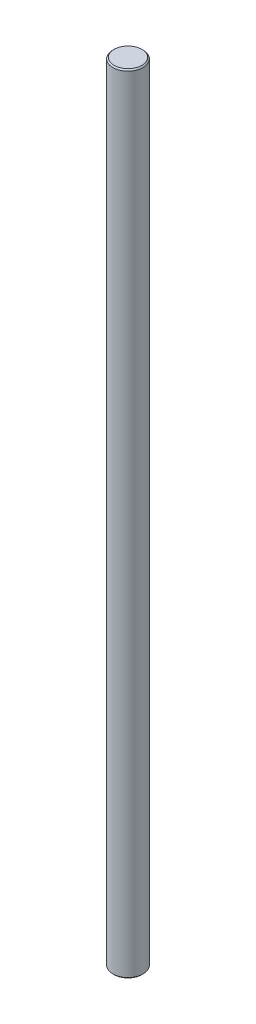
ISO-10303-21;
HEADER;
FILE_DESCRIPTION(('STEP AP214'),'2;1');
FILE_NAME('part.step','',(''),(''),'','','');
FILE_SCHEMA(('AUTOMOTIVE_DESIGN { 1 0 10303 214 1 1 1 1 }'));
ENDSEC;
DATA;
#1=APPLICATION_CONTEXT('core data for automotive mechanical design processes');
#2=APPLICATION_PROTOCOL_DEFINITION('international standard','automotive_design',2000,#1);
#3=PRODUCT_CONTEXT('',#1,'mechanical');
#4=PRODUCT('Part','Part','',(#3));
#5=PRODUCT_RELATED_PRODUCT_CATEGORY('part','',(#4));
#6=PRODUCT_DEFINITION_FORMATION('','',#4);
#7=PRODUCT_DEFINITION_CONTEXT('part definition',#1,'design');
#8=PRODUCT_DEFINITION('design','',#6,#7);
#9=PRODUCT_DEFINITION_SHAPE('','',#8);
#10=(LENGTH_UNIT() NAMED_UNIT(*) SI_UNIT(.MILLI.,.METRE.));
#11=(NAMED_UNIT(*) PLANE_ANGLE_UNIT() SI_UNIT($,.RADIAN.));
#12=(NAMED_UNIT(*) SI_UNIT($,.STERADIAN.) SOLID_ANGLE_UNIT());
#13=UNCERTAINTY_MEASURE_WITH_UNIT(LENGTH_MEASURE(1.E-05),#10,'distance_accuracy_value','');
#14=(GEOMETRIC_REPRESENTATION_CONTEXT(3) GLOBAL_UNCERTAINTY_ASSIGNED_CONTEXT((#13)) GLOBAL_UNIT_ASSIGNED_CONTEXT((#10,
#11,#12)) REPRESENTATION_CONTEXT('',''));
#15=CARTESIAN_POINT('',(0.,0.,0.));
#16=DIRECTION('',(0.,0.,1.));
#17=DIRECTION('',(1.,0.,0.));
#18=AXIS2_PLACEMENT_3D('',#15,#16,#17);
#19=CARTESIAN_POINT('',(0.,312.,0.));
#20=DIRECTION('',(0.,-1.,0.));
#21=DIRECTION('',(0.,0.,-1.));
#22=AXIS2_PLACEMENT_3D('',#19,#20,#21);
#23=CYLINDRICAL_SURFACE('',#22,6.);
#24=CARTESIAN_POINT('',(0.,311.5,0.));
#25=DIRECTION('',(0.,1.,0.));
#26=DIRECTION('',(0.,0.,1.));
#27=AXIS2_PLACEMENT_3D('',#24,#25,#26);
#28=CIRCLE('',#27,6.);
#29=CARTESIAN_POINT('',(0.,311.5,6.));
#30=VERTEX_POINT('',#29);
#31=EDGE_CURVE('E41',#30,#30,#28,.F.);
#32=ORIENTED_EDGE('',*,*,#31,.T.);
#33=EDGE_LOOP('',(#32));
#34=FACE_BOUND('',#33,.T.);
#35=CARTESIAN_POINT('',(0.,0.5,0.));
#36=DIRECTION('',(0.,1.,0.));
#37=DIRECTION('',(0.,0.,1.));
#38=AXIS2_PLACEMENT_3D('',#35,#36,#37);
#39=CIRCLE('',#38,6.);
#40=CARTESIAN_POINT('',(0.,0.5,6.));
#41=VERTEX_POINT('',#40);
#42=EDGE_CURVE('E45',#41,#41,#39,.T.);
#43=ORIENTED_EDGE('',*,*,#42,.T.);
#44=EDGE_LOOP('',(#43));
#45=FACE_BOUND('',#44,.T.);
#46=ADVANCED_FACE('F34',(#34,#45),#23,.T.);
#47=CARTESIAN_POINT('',(0.,312.,0.));
#48=DIRECTION('',(0.,1.,0.));
#49=DIRECTION('',(0.,0.,1.));
#50=AXIS2_PLACEMENT_3D('',#47,#48,#49);
#51=PLANE('',#50);
#52=CARTESIAN_POINT('',(0.,312.,0.));
#53=DIRECTION('',(0.,1.,0.));
#54=DIRECTION('',(0.,0.,1.));
#55=AXIS2_PLACEMENT_3D('',#52,#53,#54);
#56=CIRCLE('',#55,5.49999999999998);
#57=CARTESIAN_POINT('',(0.,312.,5.49999999999998));
#58=VERTEX_POINT('',#57);
#59=EDGE_CURVE('E49',#58,#58,#56,.T.);
#60=ORIENTED_EDGE('',*,*,#59,.T.);
#61=EDGE_LOOP('',(#60));
#62=FACE_BOUND('',#61,.T.);
#63=ADVANCED_FACE('F55',(#62),#51,.T.);
#64=CARTESIAN_POINT('',(0.,0.,0.));
#65=DIRECTION('',(0.,1.,0.));
#66=DIRECTION('',(0.,0.,1.));
#67=AXIS2_PLACEMENT_3D('',#64,#65,#66);
#68=PLANE('',#67);
#69=CARTESIAN_POINT('',(0.,0.,0.));
#70=DIRECTION('',(0.,1.,0.));
#71=DIRECTION('',(0.,0.,1.));
#72=AXIS2_PLACEMENT_3D('',#69,#70,#71);
#73=CIRCLE('',#72,5.50000000000001);
#74=CARTESIAN_POINT('',(0.,0.,5.50000000000001));
#75=VERTEX_POINT('',#74);
#76=EDGE_CURVE('E10',#75,#75,#73,.F.);
#77=ORIENTED_EDGE('',*,*,#76,.T.);
#78=EDGE_LOOP('',(#77));
#79=FACE_BOUND('',#78,.T.);
#80=ADVANCED_FACE('F59',(#79),#68,.F.);
#81=CARTESIAN_POINT('',(0.,312.,0.));
#82=DIRECTION('',(0.,-1.,0.));
#83=DIRECTION('',(0.,0.,-1.));
#84=AXIS2_PLACEMENT_3D('',#81,#82,#83);
#85=CONICAL_SURFACE('',#84,5.49999999999998,0.785398163397472);
#86=ORIENTED_EDGE('',*,*,#31,.F.);
#87=EDGE_LOOP('',(#86));
#88=FACE_BOUND('',#87,.T.);
#89=ORIENTED_EDGE('',*,*,#59,.F.);
#90=EDGE_LOOP('',(#89));
#91=FACE_BOUND('',#90,.T.);
#92=ADVANCED_FACE('F57',(#88,#91),#85,.T.);
#93=CARTESIAN_POINT('',(0.,0.5,0.));
#94=DIRECTION('',(0.,1.,0.));
#95=DIRECTION('',(0.,0.,1.));
#96=AXIS2_PLACEMENT_3D('',#93,#94,#95);
#97=CONICAL_SURFACE('',#96,6.,0.785398163397443);
#98=ORIENTED_EDGE('',*,*,#76,.F.);
#99=EDGE_LOOP('',(#98));
#100=FACE_BOUND('',#99,.T.);
#101=ORIENTED_EDGE('',*,*,#42,.F.);
#102=EDGE_LOOP('',(#101));
#103=FACE_BOUND('',#102,.T.);
#104=ADVANCED_FACE('F36',(#100,#103),#97,.T.);
#105=CLOSED_SHELL('',(#46,#63,#80,#92,#104));
#106=MANIFOLD_SOLID_BREP('B2',#105);
#107=ADVANCED_BREP_SHAPE_REPRESENTATION('',(#18,#106),#14);
#108=SHAPE_DEFINITION_REPRESENTATION(#9,#107);
ENDSEC;
END-ISO-10303-21;
